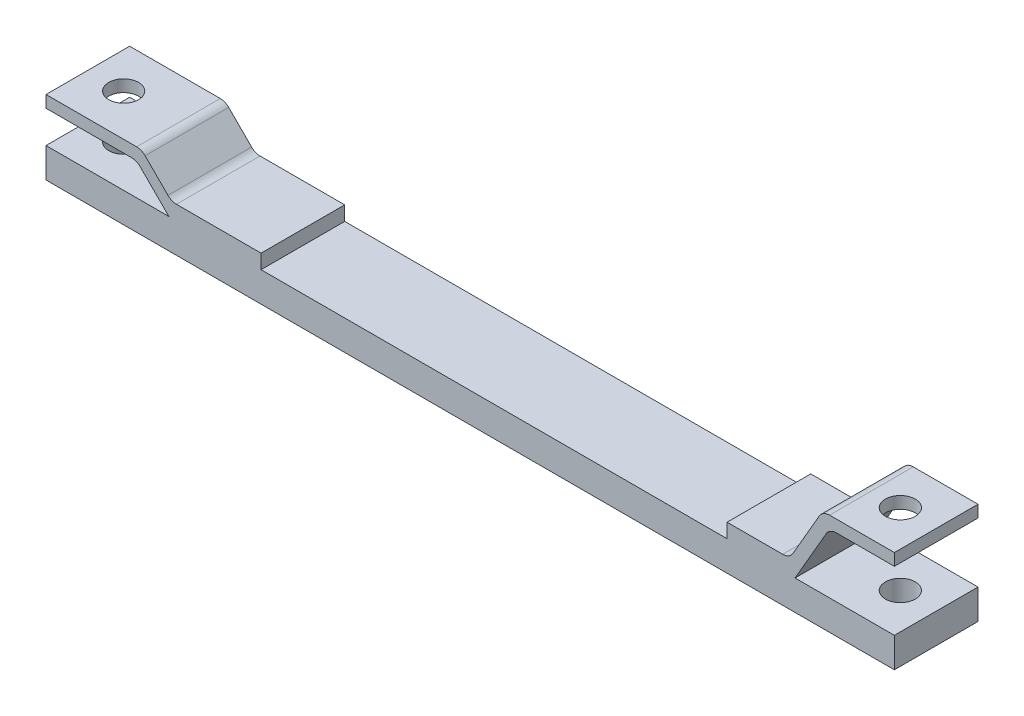
ISO-10303-21;
HEADER;
FILE_DESCRIPTION(('STEP AP214'),'2;1');
FILE_NAME('part.step','',(''),(''),'','','');
FILE_SCHEMA(('AUTOMOTIVE_DESIGN { 1 0 10303 214 1 1 1 1 }'));
ENDSEC;
DATA;
#1=APPLICATION_CONTEXT('core data for automotive mechanical design processes');
#2=APPLICATION_PROTOCOL_DEFINITION('international standard','automotive_design',2000,#1);
#3=PRODUCT_CONTEXT('',#1,'mechanical');
#4=PRODUCT('Part','Part','',(#3));
#5=PRODUCT_RELATED_PRODUCT_CATEGORY('part','',(#4));
#6=PRODUCT_DEFINITION_FORMATION('','',#4);
#7=PRODUCT_DEFINITION_CONTEXT('part definition',#1,'design');
#8=PRODUCT_DEFINITION('design','',#6,#7);
#9=PRODUCT_DEFINITION_SHAPE('','',#8);
#10=(LENGTH_UNIT() NAMED_UNIT(*) SI_UNIT(.MILLI.,.METRE.));
#11=(NAMED_UNIT(*) PLANE_ANGLE_UNIT() SI_UNIT($,.RADIAN.));
#12=(NAMED_UNIT(*) SI_UNIT($,.STERADIAN.) SOLID_ANGLE_UNIT());
#13=UNCERTAINTY_MEASURE_WITH_UNIT(LENGTH_MEASURE(1.E-05),#10,'distance_accuracy_value','');
#14=(GEOMETRIC_REPRESENTATION_CONTEXT(3) GLOBAL_UNCERTAINTY_ASSIGNED_CONTEXT((#13)) GLOBAL_UNIT_ASSIGNED_CONTEXT((#10,
#11,#12)) REPRESENTATION_CONTEXT('',''));
#15=CARTESIAN_POINT('',(0.,0.,0.));
#16=DIRECTION('',(0.,0.,1.));
#17=DIRECTION('',(1.,0.,0.));
#18=AXIS2_PLACEMENT_3D('',#15,#16,#17);
#19=CARTESIAN_POINT('',(63.9289321881345,63.9289321881345,70.));
#20=DIRECTION('',(0.707106781186548,0.707106781186548,0.));
#21=DIRECTION('',(-0.707106781186548,0.707106781186548,0.));
#22=AXIS2_PLACEMENT_3D('',#19,#20,#21);
#23=PLANE('',#22);
#24=DIRECTION('',(0.707106781186548,-0.707106781186548,0.));
#25=VECTOR('',#24,1.);
#26=CARTESIAN_POINT('',(63.9289321881345,63.9289321881345,70.));
#27=LINE('',#26,#25);
#28=CARTESIAN_POINT('',(78.7867965644036,49.0710678118655,70.));
#29=VERTEX_POINT('',#28);
#30=CARTESIAN_POINT('',(102.857864376269,25.,70.));
#31=VERTEX_POINT('',#30);
#32=EDGE_CURVE('E287',#29,#31,#27,.T.);
#33=ORIENTED_EDGE('',*,*,#32,.F.);
#34=DIRECTION('',(0.,0.,-1.));
#35=VECTOR('',#34,1.);
#36=CARTESIAN_POINT('',(78.7867965644036,49.0710678118655,0.));
#37=LINE('',#36,#35);
#38=CARTESIAN_POINT('',(78.7867965644036,49.0710678118655,0.));
#39=VERTEX_POINT('',#38);
#40=EDGE_CURVE('E385',#29,#39,#37,.T.);
#41=ORIENTED_EDGE('',*,*,#40,.T.);
#42=DIRECTION('',(0.707106781186548,-0.707106781186548,0.));
#43=VECTOR('',#42,1.);
#44=CARTESIAN_POINT('',(63.9289321881345,63.9289321881345,0.));
#45=LINE('',#44,#43);
#46=CARTESIAN_POINT('',(102.857864376269,25.,0.));
#47=VERTEX_POINT('',#46);
#48=EDGE_CURVE('E304',#39,#47,#45,.T.);
#49=ORIENTED_EDGE('',*,*,#48,.T.);
#50=DIRECTION('',(0.,0.,-1.));
#51=VECTOR('',#50,1.);
#52=CARTESIAN_POINT('',(102.857864376269,25.,70.));
#53=LINE('',#52,#51);
#54=EDGE_CURVE('E303',#31,#47,#53,.T.);
#55=ORIENTED_EDGE('',*,*,#54,.F.);
#56=EDGE_LOOP('',(#33,#41,#49,#55));
#57=FACE_BOUND('',#56,.T.);
#58=ADVANCED_FACE('F112',(#57),#23,.F.);
#59=CARTESIAN_POINT('',(180.,0.,70.));
#60=DIRECTION('',(1.,0.,0.));
#61=DIRECTION('',(0.,0.,-1.));
#62=AXIS2_PLACEMENT_3D('',#59,#60,#61);
#63=PLANE('',#62);
#64=DIRECTION('',(0.,-1.,0.));
#65=VECTOR('',#64,1.);
#66=CARTESIAN_POINT('',(180.,0.,0.));
#67=LINE('',#66,#65);
#68=CARTESIAN_POINT('',(180.,37.,0.));
#69=VERTEX_POINT('',#68);
#70=CARTESIAN_POINT('',(180.,25.,0.));
#71=VERTEX_POINT('',#70);
#72=EDGE_CURVE('E434',#69,#71,#67,.T.);
#73=ORIENTED_EDGE('',*,*,#72,.F.);
#74=DIRECTION('',(0.,0.,-1.));
#75=VECTOR('',#74,1.);
#76=CARTESIAN_POINT('',(180.,37.,70.));
#77=LINE('',#76,#75);
#78=CARTESIAN_POINT('',(180.,37.,70.));
#79=VERTEX_POINT('',#78);
#80=EDGE_CURVE('E453',#79,#69,#77,.T.);
#81=ORIENTED_EDGE('',*,*,#80,.F.);
#82=DIRECTION('',(0.,-1.,0.));
#83=VECTOR('',#82,1.);
#84=CARTESIAN_POINT('',(180.,0.,70.));
#85=LINE('',#84,#83);
#86=CARTESIAN_POINT('',(180.,25.,70.));
#87=VERTEX_POINT('',#86);
#88=EDGE_CURVE('E299',#79,#87,#85,.T.);
#89=ORIENTED_EDGE('',*,*,#88,.T.);
#90=DIRECTION('',(0.,0.,-1.));
#91=VECTOR('',#90,1.);
#92=CARTESIAN_POINT('',(180.,25.,70.));
#93=LINE('',#92,#91);
#94=EDGE_CURVE('E309',#87,#71,#93,.T.);
#95=ORIENTED_EDGE('',*,*,#94,.T.);
#96=EDGE_LOOP('',(#73,#81,#89,#95));
#97=FACE_BOUND('',#96,.T.);
#98=ADVANCED_FACE('F548',(#97),#63,.T.);
#99=CARTESIAN_POINT('',(0.,37.,70.));
#100=DIRECTION('',(0.,1.,0.));
#101=DIRECTION('',(0.,0.,1.));
#102=AXIS2_PLACEMENT_3D('',#99,#100,#101);
#103=PLANE('',#102);
#104=DIRECTION('',(1.,0.,0.));
#105=VECTOR('',#104,1.);
#106=CARTESIAN_POINT('',(0.,37.,0.));
#107=LINE('',#106,#105);
#108=CARTESIAN_POINT('',(109.142135623731,37.,0.));
#109=VERTEX_POINT('',#108);
#110=EDGE_CURVE('E438',#109,#69,#107,.T.);
#111=ORIENTED_EDGE('',*,*,#110,.F.);
#112=DIRECTION('',(0.,0.,-1.));
#113=VECTOR('',#112,1.);
#114=CARTESIAN_POINT('',(109.142135623731,37.,70.));
#115=LINE('',#114,#113);
#116=CARTESIAN_POINT('',(109.142135623731,37.,70.));
#117=VERTEX_POINT('',#116);
#118=EDGE_CURVE('E367',#109,#117,#115,.F.);
#119=ORIENTED_EDGE('',*,*,#118,.T.);
#120=DIRECTION('',(1.,0.,0.));
#121=VECTOR('',#120,1.);
#122=CARTESIAN_POINT('',(0.,37.,70.));
#123=LINE('',#122,#121);
#124=EDGE_CURVE('E420',#117,#79,#123,.T.);
#125=ORIENTED_EDGE('',*,*,#124,.T.);
#126=ORIENTED_EDGE('',*,*,#80,.T.);
#127=EDGE_LOOP('',(#111,#119,#125,#126));
#128=FACE_BOUND('',#127,.T.);
#129=ADVANCED_FACE('F552',(#128),#103,.T.);
#130=CARTESIAN_POINT('',(71.0000000000001,70.9999999999999,70.));
#131=DIRECTION('',(0.707106781186549,0.707106781186546,0.));
#132=DIRECTION('',(-0.707106781186546,0.707106781186549,0.));
#133=AXIS2_PLACEMENT_3D('',#130,#131,#132);
#134=PLANE('',#133);
#135=DIRECTION('',(0.707106781186546,-0.707106781186549,0.));
#136=VECTOR('',#135,1.);
#137=CARTESIAN_POINT('',(71.0000000000001,70.9999999999999,70.));
#138=LINE('',#137,#136);
#139=CARTESIAN_POINT('',(82.9289321881345,59.0710678118655,70.));
#140=VERTEX_POINT('',#139);
#141=CARTESIAN_POINT('',(102.071067811865,39.9289321881345,70.));
#142=VERTEX_POINT('',#141);
#143=EDGE_CURVE('E422',#140,#142,#138,.T.);
#144=ORIENTED_EDGE('',*,*,#143,.T.);
#145=DIRECTION('',(0.,0.,-1.));
#146=VECTOR('',#145,1.);
#147=CARTESIAN_POINT('',(102.071067811865,39.9289321881345,0.));
#148=LINE('',#147,#146);
#149=CARTESIAN_POINT('',(102.071067811865,39.9289321881345,0.));
#150=VERTEX_POINT('',#149);
#151=EDGE_CURVE('E364',#142,#150,#148,.T.);
#152=ORIENTED_EDGE('',*,*,#151,.T.);
#153=DIRECTION('',(0.707106781186546,-0.707106781186549,0.));
#154=VECTOR('',#153,1.);
#155=CARTESIAN_POINT('',(71.0000000000001,70.9999999999999,0.));
#156=LINE('',#155,#154);
#157=CARTESIAN_POINT('',(82.9289321881345,59.0710678118655,0.));
#158=VERTEX_POINT('',#157);
#159=EDGE_CURVE('E440',#158,#150,#156,.T.);
#160=ORIENTED_EDGE('',*,*,#159,.F.);
#161=DIRECTION('',(0.,0.,-1.));
#162=VECTOR('',#161,1.);
#163=CARTESIAN_POINT('',(82.9289321881345,59.0710678118655,70.));
#164=LINE('',#163,#162);
#165=EDGE_CURVE('E362',#158,#140,#164,.F.);
#166=ORIENTED_EDGE('',*,*,#165,.T.);
#167=EDGE_LOOP('',(#144,#152,#160,#166));
#168=FACE_BOUND('',#167,.T.);
#169=ADVANCED_FACE('F561',(#168),#134,.T.);
#170=CARTESIAN_POINT('',(0.,62.,70.));
#171=DIRECTION('',(0.,1.,0.));
#172=DIRECTION('',(0.,0.,1.));
#173=AXIS2_PLACEMENT_3D('',#170,#171,#172);
#174=PLANE('',#173);
#175=CARTESIAN_POINT('',(30.,62.,35.));
#176=DIRECTION('',(0.,1.,0.));
#177=DIRECTION('',(0.,0.,1.));
#178=AXIS2_PLACEMENT_3D('',#175,#176,#177);
#179=CIRCLE('',#178,12.5);
#180=CARTESIAN_POINT('',(30.,62.,47.5));
#181=VERTEX_POINT('',#180);
#182=EDGE_CURVE('E399',#181,#181,#179,.T.);
#183=ORIENTED_EDGE('',*,*,#182,.F.);
#184=EDGE_LOOP('',(#183));
#185=FACE_BOUND('',#184,.T.);
#186=DIRECTION('',(1.,0.,0.));
#187=VECTOR('',#186,1.);
#188=CARTESIAN_POINT('',(0.,62.,70.));
#189=LINE('',#188,#187);
#190=CARTESIAN_POINT('',(0.,62.,70.));
#191=VERTEX_POINT('',#190);
#192=CARTESIAN_POINT('',(75.857864376269,62.,70.));
#193=VERTEX_POINT('',#192);
#194=EDGE_CURVE('E425',#191,#193,#189,.T.);
#195=ORIENTED_EDGE('',*,*,#194,.T.);
#196=DIRECTION('',(0.,0.,-1.));
#197=VECTOR('',#196,1.);
#198=CARTESIAN_POINT('',(75.857864376269,62.,70.));
#199=LINE('',#198,#197);
#200=CARTESIAN_POINT('',(75.857864376269,62.,0.));
#201=VERTEX_POINT('',#200);
#202=EDGE_CURVE('E369',#193,#201,#199,.T.);
#203=ORIENTED_EDGE('',*,*,#202,.T.);
#204=DIRECTION('',(1.,0.,0.));
#205=VECTOR('',#204,1.);
#206=CARTESIAN_POINT('',(0.,62.,0.));
#207=LINE('',#206,#205);
#208=CARTESIAN_POINT('',(0.,62.,0.));
#209=VERTEX_POINT('',#208);
#210=EDGE_CURVE('E443',#209,#201,#207,.T.);
#211=ORIENTED_EDGE('',*,*,#210,.F.);
#212=DIRECTION('',(0.,0.,-1.));
#213=VECTOR('',#212,1.);
#214=CARTESIAN_POINT('',(0.,62.,70.));
#215=LINE('',#214,#213);
#216=EDGE_CURVE('E451',#191,#209,#215,.T.);
#217=ORIENTED_EDGE('',*,*,#216,.F.);
#218=EDGE_LOOP('',(#195,#203,#211,#217));
#219=FACE_BOUND('',#218,.T.);
#220=ADVANCED_FACE('F570',(#185,#219),#174,.T.);
#221=CARTESIAN_POINT('',(0.,0.,70.));
#222=DIRECTION('',(1.,0.,0.));
#223=DIRECTION('',(0.,0.,-1.));
#224=AXIS2_PLACEMENT_3D('',#221,#222,#223);
#225=PLANE('',#224);
#226=DIRECTION('',(0.,-1.,0.));
#227=VECTOR('',#226,1.);
#228=CARTESIAN_POINT('',(0.,0.,0.));
#229=LINE('',#228,#227);
#230=CARTESIAN_POINT('',(0.,52.,0.));
#231=VERTEX_POINT('',#230);
#232=EDGE_CURVE('E446',#209,#231,#229,.T.);
#233=ORIENTED_EDGE('',*,*,#232,.T.);
#234=DIRECTION('',(0.,0.,-1.));
#235=VECTOR('',#234,1.);
#236=CARTESIAN_POINT('',(0.,52.,70.));
#237=LINE('',#236,#235);
#238=CARTESIAN_POINT('',(0.,52.,70.));
#239=VERTEX_POINT('',#238);
#240=EDGE_CURVE('E432',#239,#231,#237,.T.);
#241=ORIENTED_EDGE('',*,*,#240,.F.);
#242=DIRECTION('',(0.,-1.,0.));
#243=VECTOR('',#242,1.);
#244=CARTESIAN_POINT('',(0.,0.,70.));
#245=LINE('',#244,#243);
#246=EDGE_CURVE('E428',#191,#239,#245,.T.);
#247=ORIENTED_EDGE('',*,*,#246,.F.);
#248=ORIENTED_EDGE('',*,*,#216,.T.);
#249=EDGE_LOOP('',(#233,#241,#247,#248));
#250=FACE_BOUND('',#249,.T.);
#251=ADVANCED_FACE('F575',(#250),#225,.F.);
#252=CARTESIAN_POINT('',(0.,52.,70.));
#253=DIRECTION('',(0.,1.,0.));
#254=DIRECTION('',(0.,0.,1.));
#255=AXIS2_PLACEMENT_3D('',#252,#253,#254);
#256=PLANE('',#255);
#257=CARTESIAN_POINT('',(30.,52.,35.));
#258=DIRECTION('',(0.,1.,0.));
#259=DIRECTION('',(0.,0.,1.));
#260=AXIS2_PLACEMENT_3D('',#257,#258,#259);
#261=CIRCLE('',#260,12.5);
#262=CARTESIAN_POINT('',(30.,52.,47.5));
#263=VERTEX_POINT('',#262);
#264=EDGE_CURVE('E394',#263,#263,#261,.T.);
#265=ORIENTED_EDGE('',*,*,#264,.T.);
#266=EDGE_LOOP('',(#265));
#267=FACE_BOUND('',#266,.T.);
#268=DIRECTION('',(1.,0.,0.));
#269=VECTOR('',#268,1.);
#270=CARTESIAN_POINT('',(0.,52.,0.));
#271=LINE('',#270,#269);
#272=CARTESIAN_POINT('',(71.7157287525381,52.,0.));
#273=VERTEX_POINT('',#272);
#274=EDGE_CURVE('E300',#231,#273,#271,.T.);
#275=ORIENTED_EDGE('',*,*,#274,.T.);
#276=DIRECTION('',(0.,0.,-1.));
#277=VECTOR('',#276,1.);
#278=CARTESIAN_POINT('',(71.7157287525381,52.,70.));
#279=LINE('',#278,#277);
#280=CARTESIAN_POINT('',(71.7157287525381,52.,70.));
#281=VERTEX_POINT('',#280);
#282=EDGE_CURVE('E129',#273,#281,#279,.F.);
#283=ORIENTED_EDGE('',*,*,#282,.T.);
#284=DIRECTION('',(1.,0.,0.));
#285=VECTOR('',#284,1.);
#286=CARTESIAN_POINT('',(0.,52.,70.));
#287=LINE('',#286,#285);
#288=EDGE_CURVE('E430',#239,#281,#287,.T.);
#289=ORIENTED_EDGE('',*,*,#288,.F.);
#290=ORIENTED_EDGE('',*,*,#240,.T.);
#291=EDGE_LOOP('',(#275,#283,#289,#290));
#292=FACE_BOUND('',#291,.T.);
#293=ADVANCED_FACE('F576',(#267,#292),#256,.F.);
#294=CARTESIAN_POINT('',(0.,0.,70.));
#295=DIRECTION('',(0.,0.,1.));
#296=DIRECTION('',(1.,0.,0.));
#297=AXIS2_PLACEMENT_3D('',#294,#295,#296);
#298=PLANE('',#297);
#299=DIRECTION('',(-1.,0.,0.));
#300=VECTOR('',#299,1.);
#301=CARTESIAN_POINT('',(0.,84.9999999999997,70.));
#302=LINE('',#301,#300);
#303=CARTESIAN_POINT('',(710.,85.,70.));
#304=VERTEX_POINT('',#303);
#305=CARTESIAN_POINT('',(655.773502691896,85.,70.));
#306=VERTEX_POINT('',#305);
#307=EDGE_CURVE('E466',#304,#306,#302,.T.);
#308=ORIENTED_EDGE('',*,*,#307,.T.);
#309=CARTESIAN_POINT('',(655.773502691896,75.,70.));
#310=DIRECTION('',(0.,0.,1.));
#311=DIRECTION('',(1.,0.,0.));
#312=AXIS2_PLACEMENT_3D('',#309,#310,#311);
#313=CIRCLE('',#312,10.);
#314=CARTESIAN_POINT('',(647.113248654052,80.0000000000001,70.));
#315=VERTEX_POINT('',#314);
#316=EDGE_CURVE('E360',#306,#315,#313,.T.);
#317=ORIENTED_EDGE('',*,*,#316,.T.);
#318=DIRECTION('',(-0.500000000000004,-0.866025403784437,0.));
#319=VECTOR('',#318,1.);
#320=CARTESIAN_POINT('',(450.693920339159,-260.208256229944,70.));
#321=LINE('',#320,#319);
#322=CARTESIAN_POINT('',(625.173938424846,42.0000000000001,70.));
#323=VERTEX_POINT('',#322);
#324=EDGE_CURVE('E468',#315,#323,#321,.T.);
#325=ORIENTED_EDGE('',*,*,#324,.T.);
#326=CARTESIAN_POINT('',(616.513684387001,47.,70.));
#327=DIRECTION('',(0.,0.,1.));
#328=DIRECTION('',(1.,0.,0.));
#329=AXIS2_PLACEMENT_3D('',#326,#327,#328);
#330=CIRCLE('',#329,10.);
#331=CARTESIAN_POINT('',(616.513684387001,37.,70.));
#332=VERTEX_POINT('',#331);
#333=EDGE_CURVE('E374',#323,#332,#330,.F.);
#334=ORIENTED_EDGE('',*,*,#333,.T.);
#335=DIRECTION('',(-1.,0.,0.));
#336=VECTOR('',#335,1.);
#337=CARTESIAN_POINT('',(0.,36.9999999999999,70.));
#338=LINE('',#337,#336);
#339=CARTESIAN_POINT('',(570.,37.,70.));
#340=VERTEX_POINT('',#339);
#341=EDGE_CURVE('E471',#332,#340,#338,.T.);
#342=ORIENTED_EDGE('',*,*,#341,.T.);
#343=DIRECTION('',(0.,-1.,0.));
#344=VECTOR('',#343,1.);
#345=CARTESIAN_POINT('',(570.,0.,70.));
#346=LINE('',#345,#344);
#347=CARTESIAN_POINT('',(570.,25.,70.));
#348=VERTEX_POINT('',#347);
#349=EDGE_CURVE('E473',#340,#348,#346,.T.);
#350=ORIENTED_EDGE('',*,*,#349,.T.);
#351=DIRECTION('',(1.,0.,0.));
#352=VECTOR('',#351,1.);
#353=CARTESIAN_POINT('',(0.,25.,70.));
#354=LINE('',#353,#352);
#355=EDGE_CURVE('E314',#87,#348,#354,.T.);
#356=ORIENTED_EDGE('',*,*,#355,.F.);
#357=ORIENTED_EDGE('',*,*,#88,.F.);
#358=ORIENTED_EDGE('',*,*,#124,.F.);
#359=CARTESIAN_POINT('',(109.142135623731,47.,70.));
#360=DIRECTION('',(0.,0.,1.));
#361=DIRECTION('',(1.,0.,0.));
#362=AXIS2_PLACEMENT_3D('',#359,#360,#361);
#363=CIRCLE('',#362,10.);
#364=EDGE_CURVE('E378',#117,#142,#363,.F.);
#365=ORIENTED_EDGE('',*,*,#364,.T.);
#366=ORIENTED_EDGE('',*,*,#143,.F.);
#367=CARTESIAN_POINT('',(75.857864376269,52.,70.));
#368=DIRECTION('',(0.,0.,1.));
#369=DIRECTION('',(1.,0.,0.));
#370=AXIS2_PLACEMENT_3D('',#367,#368,#369);
#371=CIRCLE('',#370,10.);
#372=EDGE_CURVE('E358',#140,#193,#371,.T.);
#373=ORIENTED_EDGE('',*,*,#372,.T.);
#374=ORIENTED_EDGE('',*,*,#194,.F.);
#375=ORIENTED_EDGE('',*,*,#246,.T.);
#376=ORIENTED_EDGE('',*,*,#288,.T.);
#377=CARTESIAN_POINT('',(71.7157287525381,42.,70.));
#378=DIRECTION('',(0.,0.,1.));
#379=DIRECTION('',(1.,0.,0.));
#380=AXIS2_PLACEMENT_3D('',#377,#378,#379);
#381=CIRCLE('',#380,10.);
#382=EDGE_CURVE('E12',#281,#29,#381,.F.);
#383=ORIENTED_EDGE('',*,*,#382,.T.);
#384=ORIENTED_EDGE('',*,*,#32,.T.);
#385=CARTESIAN_POINT('',(0.,25.,70.));
#386=VERTEX_POINT('',#385);
#387=EDGE_CURVE('E293',#386,#31,#354,.T.);
#388=ORIENTED_EDGE('',*,*,#387,.F.);
#389=DIRECTION('',(0.,1.,0.));
#390=VECTOR('',#389,1.);
#391=CARTESIAN_POINT('',(0.,0.,70.));
#392=LINE('',#391,#390);
#393=CARTESIAN_POINT('',(0.,0.,70.));
#394=VERTEX_POINT('',#393);
#395=EDGE_CURVE('E344',#394,#386,#392,.T.);
#396=ORIENTED_EDGE('',*,*,#395,.F.);
#397=DIRECTION('',(1.,0.,0.));
#398=VECTOR('',#397,1.);
#399=CARTESIAN_POINT('',(0.,0.,70.));
#400=LINE('',#399,#398);
#401=CARTESIAN_POINT('',(710.,0.,70.));
#402=VERTEX_POINT('',#401);
#403=EDGE_CURVE('E318',#394,#402,#400,.T.);
#404=ORIENTED_EDGE('',*,*,#403,.T.);
#405=DIRECTION('',(0.,1.,0.));
#406=VECTOR('',#405,1.);
#407=CARTESIAN_POINT('',(710.,0.,70.));
#408=LINE('',#407,#406);
#409=CARTESIAN_POINT('',(710.,25.,70.));
#410=VERTEX_POINT('',#409);
#411=EDGE_CURVE('E313',#402,#410,#408,.T.);
#412=ORIENTED_EDGE('',*,*,#411,.T.);
#413=CARTESIAN_POINT('',(626.905989232415,25.,70.));
#414=VERTEX_POINT('',#413);
#415=EDGE_CURVE('E316',#414,#410,#354,.T.);
#416=ORIENTED_EDGE('',*,*,#415,.F.);
#417=DIRECTION('',(-0.500000000000015,-0.86602540378443,0.));
#418=VECTOR('',#417,1.);
#419=CARTESIAN_POINT('',(459.354174376996,-265.208256229948,70.));
#420=LINE('',#419,#418);
#421=CARTESIAN_POINT('',(652.886751345949,70.0000000000002,70.));
#422=VERTEX_POINT('',#421);
#423=EDGE_CURVE('E457',#422,#414,#420,.T.);
#424=ORIENTED_EDGE('',*,*,#423,.F.);
#425=CARTESIAN_POINT('',(661.547005383793,65.,70.));
#426=DIRECTION('',(0.,0.,1.));
#427=DIRECTION('',(1.,0.,0.));
#428=AXIS2_PLACEMENT_3D('',#425,#426,#427);
#429=CIRCLE('',#428,10.);
#430=CARTESIAN_POINT('',(661.547005383793,75.,70.));
#431=VERTEX_POINT('',#430);
#432=EDGE_CURVE('E390',#422,#431,#429,.F.);
#433=ORIENTED_EDGE('',*,*,#432,.T.);
#434=DIRECTION('',(-1.,0.,0.));
#435=VECTOR('',#434,1.);
#436=CARTESIAN_POINT('',(0.,75.,70.));
#437=LINE('',#436,#435);
#438=CARTESIAN_POINT('',(710.,75.,70.));
#439=VERTEX_POINT('',#438);
#440=EDGE_CURVE('E459',#439,#431,#437,.T.);
#441=ORIENTED_EDGE('',*,*,#440,.F.);
#442=DIRECTION('',(0.,-1.,0.));
#443=VECTOR('',#442,1.);
#444=CARTESIAN_POINT('',(710.,0.,70.));
#445=LINE('',#444,#443);
#446=EDGE_CURVE('E463',#304,#439,#445,.T.);
#447=ORIENTED_EDGE('',*,*,#446,.F.);
#448=EDGE_LOOP('',(#308,#317,#325,#334,#342,#350,#356,#357,#358,#365,#366,#373,#374,#375,#376,
#383,#384,#388,#396,#404,#412,#416,#424,#433,#441,#447));
#449=FACE_BOUND('',#448,.T.);
#450=ADVANCED_FACE('F290',(#449),#298,.T.);
#451=CARTESIAN_POINT('',(0.,0.,0.));
#452=DIRECTION('',(0.,0.,1.));
#453=DIRECTION('',(1.,0.,0.));
#454=AXIS2_PLACEMENT_3D('',#451,#452,#453);
#455=PLANE('',#454);
#456=DIRECTION('',(-0.500000000000004,-0.866025403784437,0.));
#457=VECTOR('',#456,1.);
#458=CARTESIAN_POINT('',(450.693920339159,-260.208256229944,0.));
#459=LINE('',#458,#457);
#460=CARTESIAN_POINT('',(647.113248654052,80.0000000000001,0.));
#461=VERTEX_POINT('',#460);
#462=CARTESIAN_POINT('',(625.173938424846,42.0000000000001,0.));
#463=VERTEX_POINT('',#462);
#464=EDGE_CURVE('E487',#461,#463,#459,.T.);
#465=ORIENTED_EDGE('',*,*,#464,.F.);
#466=CARTESIAN_POINT('',(655.773502691896,75.,0.));
#467=DIRECTION('',(0.,0.,1.));
#468=DIRECTION('',(1.,0.,0.));
#469=AXIS2_PLACEMENT_3D('',#466,#467,#468);
#470=CIRCLE('',#469,10.);
#471=CARTESIAN_POINT('',(655.773502691896,85.,0.));
#472=VERTEX_POINT('',#471);
#473=EDGE_CURVE('E354',#461,#472,#470,.F.);
#474=ORIENTED_EDGE('',*,*,#473,.T.);
#475=DIRECTION('',(-1.,0.,0.));
#476=VECTOR('',#475,1.);
#477=CARTESIAN_POINT('',(0.,84.9999999999997,0.));
#478=LINE('',#477,#476);
#479=CARTESIAN_POINT('',(710.,85.,0.));
#480=VERTEX_POINT('',#479);
#481=EDGE_CURVE('E484',#480,#472,#478,.T.);
#482=ORIENTED_EDGE('',*,*,#481,.F.);
#483=DIRECTION('',(0.,-1.,0.));
#484=VECTOR('',#483,1.);
#485=CARTESIAN_POINT('',(710.,0.,0.));
#486=LINE('',#485,#484);
#487=CARTESIAN_POINT('',(710.,75.,0.));
#488=VERTEX_POINT('',#487);
#489=EDGE_CURVE('E481',#480,#488,#486,.T.);
#490=ORIENTED_EDGE('',*,*,#489,.T.);
#491=DIRECTION('',(-1.,0.,0.));
#492=VECTOR('',#491,1.);
#493=CARTESIAN_POINT('',(0.,75.,0.));
#494=LINE('',#493,#492);
#495=CARTESIAN_POINT('',(661.547005383793,75.,0.));
#496=VERTEX_POINT('',#495);
#497=EDGE_CURVE('E478',#488,#496,#494,.T.);
#498=ORIENTED_EDGE('',*,*,#497,.T.);
#499=CARTESIAN_POINT('',(661.547005383793,65.,0.));
#500=DIRECTION('',(0.,0.,1.));
#501=DIRECTION('',(1.,0.,0.));
#502=AXIS2_PLACEMENT_3D('',#499,#500,#501);
#503=CIRCLE('',#502,10.);
#504=CARTESIAN_POINT('',(652.886751345949,70.0000000000002,0.));
#505=VERTEX_POINT('',#504);
#506=EDGE_CURVE('E388',#496,#505,#503,.T.);
#507=ORIENTED_EDGE('',*,*,#506,.T.);
#508=DIRECTION('',(-0.500000000000015,-0.86602540378443,0.));
#509=VECTOR('',#508,1.);
#510=CARTESIAN_POINT('',(459.354174376996,-265.208256229948,0.));
#511=LINE('',#510,#509);
#512=CARTESIAN_POINT('',(626.905989232415,25.,0.));
#513=VERTEX_POINT('',#512);
#514=EDGE_CURVE('E336',#505,#513,#511,.T.);
#515=ORIENTED_EDGE('',*,*,#514,.T.);
#516=DIRECTION('',(1.,0.,0.));
#517=VECTOR('',#516,1.);
#518=CARTESIAN_POINT('',(0.,25.,0.));
#519=LINE('',#518,#517);
#520=CARTESIAN_POINT('',(710.,25.,0.));
#521=VERTEX_POINT('',#520);
#522=EDGE_CURVE('E416',#513,#521,#519,.T.);
#523=ORIENTED_EDGE('',*,*,#522,.T.);
#524=DIRECTION('',(0.,1.,0.));
#525=VECTOR('',#524,1.);
#526=CARTESIAN_POINT('',(710.,0.,0.));
#527=LINE('',#526,#525);
#528=CARTESIAN_POINT('',(710.,0.,0.));
#529=VERTEX_POINT('',#528);
#530=EDGE_CURVE('E331',#529,#521,#527,.T.);
#531=ORIENTED_EDGE('',*,*,#530,.F.);
#532=DIRECTION('',(1.,0.,0.));
#533=VECTOR('',#532,1.);
#534=CARTESIAN_POINT('',(0.,0.,0.));
#535=LINE('',#534,#533);
#536=CARTESIAN_POINT('',(0.,0.,0.));
#537=VERTEX_POINT('',#536);
#538=EDGE_CURVE('E327',#537,#529,#535,.T.);
#539=ORIENTED_EDGE('',*,*,#538,.F.);
#540=DIRECTION('',(0.,1.,0.));
#541=VECTOR('',#540,1.);
#542=CARTESIAN_POINT('',(0.,0.,0.));
#543=LINE('',#542,#541);
#544=CARTESIAN_POINT('',(0.,25.,0.));
#545=VERTEX_POINT('',#544);
#546=EDGE_CURVE('E321',#537,#545,#543,.T.);
#547=ORIENTED_EDGE('',*,*,#546,.T.);
#548=EDGE_CURVE('E621',#545,#47,#519,.T.);
#549=ORIENTED_EDGE('',*,*,#548,.T.);
#550=ORIENTED_EDGE('',*,*,#48,.F.);
#551=CARTESIAN_POINT('',(71.7157287525381,42.,0.));
#552=DIRECTION('',(0.,0.,1.));
#553=DIRECTION('',(1.,0.,0.));
#554=AXIS2_PLACEMENT_3D('',#551,#552,#553);
#555=CIRCLE('',#554,10.);
#556=EDGE_CURVE('E121',#39,#273,#555,.T.);
#557=ORIENTED_EDGE('',*,*,#556,.T.);
#558=ORIENTED_EDGE('',*,*,#274,.F.);
#559=ORIENTED_EDGE('',*,*,#232,.F.);
#560=ORIENTED_EDGE('',*,*,#210,.T.);
#561=CARTESIAN_POINT('',(75.857864376269,52.,0.));
#562=DIRECTION('',(0.,0.,1.));
#563=DIRECTION('',(1.,0.,0.));
#564=AXIS2_PLACEMENT_3D('',#561,#562,#563);
#565=CIRCLE('',#564,10.);
#566=EDGE_CURVE('E352',#201,#158,#565,.F.);
#567=ORIENTED_EDGE('',*,*,#566,.T.);
#568=ORIENTED_EDGE('',*,*,#159,.T.);
#569=CARTESIAN_POINT('',(109.142135623731,47.,0.));
#570=DIRECTION('',(0.,0.,1.));
#571=DIRECTION('',(1.,0.,0.));
#572=AXIS2_PLACEMENT_3D('',#569,#570,#571);
#573=CIRCLE('',#572,10.);
#574=EDGE_CURVE('E376',#150,#109,#573,.T.);
#575=ORIENTED_EDGE('',*,*,#574,.T.);
#576=ORIENTED_EDGE('',*,*,#110,.T.);
#577=ORIENTED_EDGE('',*,*,#72,.T.);
#578=CARTESIAN_POINT('',(570.,25.,0.));
#579=VERTEX_POINT('',#578);
#580=EDGE_CURVE('E622',#71,#579,#519,.T.);
#581=ORIENTED_EDGE('',*,*,#580,.T.);
#582=DIRECTION('',(0.,-1.,0.));
#583=VECTOR('',#582,1.);
#584=CARTESIAN_POINT('',(570.,0.,0.));
#585=LINE('',#584,#583);
#586=CARTESIAN_POINT('',(570.,37.,0.));
#587=VERTEX_POINT('',#586);
#588=EDGE_CURVE('E460',#587,#579,#585,.T.);
#589=ORIENTED_EDGE('',*,*,#588,.F.);
#590=DIRECTION('',(-1.,0.,0.));
#591=VECTOR('',#590,1.);
#592=CARTESIAN_POINT('',(0.,36.9999999999999,0.));
#593=LINE('',#592,#591);
#594=CARTESIAN_POINT('',(616.513684387001,37.,0.));
#595=VERTEX_POINT('',#594);
#596=EDGE_CURVE('E490',#595,#587,#593,.T.);
#597=ORIENTED_EDGE('',*,*,#596,.F.);
#598=CARTESIAN_POINT('',(616.513684387001,47.,0.));
#599=DIRECTION('',(0.,0.,1.));
#600=DIRECTION('',(1.,0.,0.));
#601=AXIS2_PLACEMENT_3D('',#598,#599,#600);
#602=CIRCLE('',#601,10.);
#603=EDGE_CURVE('E372',#595,#463,#602,.T.);
#604=ORIENTED_EDGE('',*,*,#603,.T.);
#605=EDGE_LOOP('',(#465,#474,#482,#490,#498,#507,#515,#523,#531,#539,#547,#549,#550,#557,#558,
#559,#560,#567,#568,#575,#576,#577,#581,#589,#597,#604));
#606=FACE_BOUND('',#605,.T.);
#607=ADVANCED_FACE('F514',(#606),#455,.F.);
#608=CARTESIAN_POINT('',(0.,75.,70.));
#609=DIRECTION('',(0.,-1.,0.));
#610=DIRECTION('',(0.,0.,-1.));
#611=AXIS2_PLACEMENT_3D('',#608,#609,#610);
#612=PLANE('',#611);
#613=CARTESIAN_POINT('',(680.,75.,35.));
#614=DIRECTION('',(0.,-1.,0.));
#615=DIRECTION('',(0.,0.,-1.));
#616=AXIS2_PLACEMENT_3D('',#613,#614,#615);
#617=CIRCLE('',#616,12.5);
#618=CARTESIAN_POINT('',(680.,75.,22.5));
#619=VERTEX_POINT('',#618);
#620=EDGE_CURVE('E414',#619,#619,#617,.T.);
#621=ORIENTED_EDGE('',*,*,#620,.F.);
#622=EDGE_LOOP('',(#621));
#623=FACE_BOUND('',#622,.T.);
#624=ORIENTED_EDGE('',*,*,#440,.T.);
#625=DIRECTION('',(0.,0.,-1.));
#626=VECTOR('',#625,1.);
#627=CARTESIAN_POINT('',(661.547005383793,75.,0.));
#628=LINE('',#627,#626);
#629=EDGE_CURVE('E380',#431,#496,#628,.T.);
#630=ORIENTED_EDGE('',*,*,#629,.T.);
#631=ORIENTED_EDGE('',*,*,#497,.F.);
#632=DIRECTION('',(0.,0.,-1.));
#633=VECTOR('',#632,1.);
#634=CARTESIAN_POINT('',(710.,75.,70.));
#635=LINE('',#634,#633);
#636=EDGE_CURVE('E435',#439,#488,#635,.T.);
#637=ORIENTED_EDGE('',*,*,#636,.F.);
#638=EDGE_LOOP('',(#624,#630,#631,#637));
#639=FACE_BOUND('',#638,.T.);
#640=ADVANCED_FACE('F510',(#623,#639),#612,.T.);
#641=CARTESIAN_POINT('',(710.,0.,70.));
#642=DIRECTION('',(1.,0.,0.));
#643=DIRECTION('',(0.,0.,-1.));
#644=AXIS2_PLACEMENT_3D('',#641,#642,#643);
#645=PLANE('',#644);
#646=ORIENTED_EDGE('',*,*,#489,.F.);
#647=DIRECTION('',(0.,0.,-1.));
#648=VECTOR('',#647,1.);
#649=CARTESIAN_POINT('',(710.,85.,70.));
#650=LINE('',#649,#648);
#651=EDGE_CURVE('E502',#304,#480,#650,.T.);
#652=ORIENTED_EDGE('',*,*,#651,.F.);
#653=ORIENTED_EDGE('',*,*,#446,.T.);
#654=ORIENTED_EDGE('',*,*,#636,.T.);
#655=EDGE_LOOP('',(#646,#652,#653,#654));
#656=FACE_BOUND('',#655,.T.);
#657=ADVANCED_FACE('F506',(#656),#645,.T.);
#658=CARTESIAN_POINT('',(0.,84.9999999999997,70.));
#659=DIRECTION('',(0.,-1.,0.));
#660=DIRECTION('',(1.,0.,0.));
#661=AXIS2_PLACEMENT_3D('',#658,#659,#660);
#662=PLANE('',#661);
#663=CARTESIAN_POINT('',(680.,85.,35.));
#664=DIRECTION('',(0.,1.,0.));
#665=DIRECTION('',(-1.,0.,0.));
#666=AXIS2_PLACEMENT_3D('',#663,#664,#665);
#667=CIRCLE('',#666,12.5);
#668=CARTESIAN_POINT('',(667.5,85.,35.));
#669=VERTEX_POINT('',#668);
#670=EDGE_CURVE('E402',#669,#669,#667,.T.);
#671=ORIENTED_EDGE('',*,*,#670,.F.);
#672=EDGE_LOOP('',(#671));
#673=FACE_BOUND('',#672,.T.);
#674=ORIENTED_EDGE('',*,*,#481,.T.);
#675=DIRECTION('',(0.,0.,-1.));
#676=VECTOR('',#675,1.);
#677=CARTESIAN_POINT('',(655.773502691896,85.,70.));
#678=LINE('',#677,#676);
#679=EDGE_CURVE('E356',#472,#306,#678,.F.);
#680=ORIENTED_EDGE('',*,*,#679,.T.);
#681=ORIENTED_EDGE('',*,*,#307,.F.);
#682=ORIENTED_EDGE('',*,*,#651,.T.);
#683=EDGE_LOOP('',(#674,#680,#681,#682));
#684=FACE_BOUND('',#683,.T.);
#685=ADVANCED_FACE('F517',(#673,#684),#662,.F.);
#686=CARTESIAN_POINT('',(450.693920339159,-260.208256229944,70.));
#687=DIRECTION('',(0.866025403784436,-0.500000000000004,0.));
#688=DIRECTION('',(0.500000000000004,0.866025403784437,0.));
#689=AXIS2_PLACEMENT_3D('',#686,#687,#688);
#690=PLANE('',#689);
#691=ORIENTED_EDGE('',*,*,#464,.T.);
#692=DIRECTION('',(0.,0.,-1.));
#693=VECTOR('',#692,1.);
#694=CARTESIAN_POINT('',(625.173938424846,42.,70.));
#695=LINE('',#694,#693);
#696=EDGE_CURVE('E350',#463,#323,#695,.F.);
#697=ORIENTED_EDGE('',*,*,#696,.T.);
#698=ORIENTED_EDGE('',*,*,#324,.F.);
#699=DIRECTION('',(0.,0.,-1.));
#700=VECTOR('',#699,1.);
#701=CARTESIAN_POINT('',(647.113248654052,80.,70.));
#702=LINE('',#701,#700);
#703=EDGE_CURVE('E347',#315,#461,#702,.T.);
#704=ORIENTED_EDGE('',*,*,#703,.T.);
#705=EDGE_LOOP('',(#691,#697,#698,#704));
#706=FACE_BOUND('',#705,.T.);
#707=ADVANCED_FACE('F526',(#706),#690,.F.);
#708=CARTESIAN_POINT('',(0.,36.9999999999999,70.));
#709=DIRECTION('',(0.,-1.,0.));
#710=DIRECTION('',(1.,0.,0.));
#711=AXIS2_PLACEMENT_3D('',#708,#709,#710);
#712=PLANE('',#711);
#713=ORIENTED_EDGE('',*,*,#341,.F.);
#714=DIRECTION('',(0.,0.,-1.));
#715=VECTOR('',#714,1.);
#716=CARTESIAN_POINT('',(616.513684387001,37.,0.));
#717=LINE('',#716,#715);
#718=EDGE_CURVE('E308',#332,#595,#717,.T.);
#719=ORIENTED_EDGE('',*,*,#718,.T.);
#720=ORIENTED_EDGE('',*,*,#596,.T.);
#721=DIRECTION('',(0.,0.,-1.));
#722=VECTOR('',#721,1.);
#723=CARTESIAN_POINT('',(570.,37.,70.));
#724=LINE('',#723,#722);
#725=EDGE_CURVE('E499',#340,#587,#724,.T.);
#726=ORIENTED_EDGE('',*,*,#725,.F.);
#727=EDGE_LOOP('',(#713,#719,#720,#726));
#728=FACE_BOUND('',#727,.T.);
#729=ADVANCED_FACE('F534',(#728),#712,.F.);
#730=CARTESIAN_POINT('',(459.354174376996,-265.208256229948,70.));
#731=DIRECTION('',(0.86602540378443,-0.500000000000015,0.));
#732=DIRECTION('',(0.500000000000015,0.86602540378443,0.));
#733=AXIS2_PLACEMENT_3D('',#730,#731,#732);
#734=PLANE('',#733);
#735=ORIENTED_EDGE('',*,*,#514,.F.);
#736=DIRECTION('',(0.,0.,-1.));
#737=VECTOR('',#736,1.);
#738=CARTESIAN_POINT('',(652.886751345949,70.0000000000001,70.));
#739=LINE('',#738,#737);
#740=EDGE_CURVE('E383',#505,#422,#739,.F.);
#741=ORIENTED_EDGE('',*,*,#740,.T.);
#742=ORIENTED_EDGE('',*,*,#423,.T.);
#743=DIRECTION('',(0.,0.,-1.));
#744=VECTOR('',#743,1.);
#745=CARTESIAN_POINT('',(626.905989232415,25.,70.));
#746=LINE('',#745,#744);
#747=EDGE_CURVE('E476',#414,#513,#746,.T.);
#748=ORIENTED_EDGE('',*,*,#747,.T.);
#749=EDGE_LOOP('',(#735,#741,#742,#748));
#750=FACE_BOUND('',#749,.T.);
#751=ADVANCED_FACE('F607',(#750),#734,.T.);
#752=CARTESIAN_POINT('',(570.,0.,70.));
#753=DIRECTION('',(1.,0.,0.));
#754=DIRECTION('',(0.,0.,-1.));
#755=AXIS2_PLACEMENT_3D('',#752,#753,#754);
#756=PLANE('',#755);
#757=ORIENTED_EDGE('',*,*,#588,.T.);
#758=DIRECTION('',(0.,0.,-1.));
#759=VECTOR('',#758,1.);
#760=CARTESIAN_POINT('',(570.,25.,70.));
#761=LINE('',#760,#759);
#762=EDGE_CURVE('E496',#348,#579,#761,.T.);
#763=ORIENTED_EDGE('',*,*,#762,.F.);
#764=ORIENTED_EDGE('',*,*,#349,.F.);
#765=ORIENTED_EDGE('',*,*,#725,.T.);
#766=EDGE_LOOP('',(#757,#763,#764,#765));
#767=FACE_BOUND('',#766,.T.);
#768=ADVANCED_FACE('F540',(#767),#756,.F.);
#769=CARTESIAN_POINT('',(0.,0.,70.));
#770=DIRECTION('',(-1.,0.,0.));
#771=DIRECTION('',(0.,0.,1.));
#772=AXIS2_PLACEMENT_3D('',#769,#770,#771);
#773=PLANE('',#772);
#774=ORIENTED_EDGE('',*,*,#546,.F.);
#775=DIRECTION('',(0.,0.,-1.));
#776=VECTOR('',#775,1.);
#777=CARTESIAN_POINT('',(0.,0.,70.));
#778=LINE('',#777,#776);
#779=EDGE_CURVE('E337',#394,#537,#778,.T.);
#780=ORIENTED_EDGE('',*,*,#779,.F.);
#781=ORIENTED_EDGE('',*,*,#395,.T.);
#782=DIRECTION('',(0.,0.,-1.));
#783=VECTOR('',#782,1.);
#784=CARTESIAN_POINT('',(0.,25.,70.));
#785=LINE('',#784,#783);
#786=EDGE_CURVE('E312',#386,#545,#785,.T.);
#787=ORIENTED_EDGE('',*,*,#786,.T.);
#788=EDGE_LOOP('',(#774,#780,#781,#787));
#789=FACE_BOUND('',#788,.T.);
#790=ADVANCED_FACE('F597',(#789),#773,.T.);
#791=CARTESIAN_POINT('',(0.,0.,70.));
#792=DIRECTION('',(0.,1.,0.));
#793=DIRECTION('',(0.,0.,1.));
#794=AXIS2_PLACEMENT_3D('',#791,#792,#793);
#795=PLANE('',#794);
#796=CARTESIAN_POINT('',(680.,0.,35.));
#797=DIRECTION('',(0.,1.,0.));
#798=DIRECTION('',(-1.,0.,0.));
#799=AXIS2_PLACEMENT_3D('',#796,#797,#798);
#800=CIRCLE('',#799,12.5);
#801=CARTESIAN_POINT('',(667.5,0.,35.));
#802=VERTEX_POINT('',#801);
#803=EDGE_CURVE('E395',#802,#802,#800,.T.);
#804=ORIENTED_EDGE('',*,*,#803,.T.);
#805=EDGE_LOOP('',(#804));
#806=FACE_BOUND('',#805,.T.);
#807=CARTESIAN_POINT('',(30.,-3.19189119579733E-13,35.));
#808=DIRECTION('',(0.,1.,0.));
#809=DIRECTION('',(-1.,0.,0.));
#810=AXIS2_PLACEMENT_3D('',#807,#808,#809);
#811=CIRCLE('',#810,12.5);
#812=CARTESIAN_POINT('',(17.5,-3.24971531166322E-13,35.));
#813=VERTEX_POINT('',#812);
#814=EDGE_CURVE('E407',#813,#813,#811,.T.);
#815=ORIENTED_EDGE('',*,*,#814,.T.);
#816=EDGE_LOOP('',(#815));
#817=FACE_BOUND('',#816,.T.);
#818=ORIENTED_EDGE('',*,*,#538,.T.);
#819=DIRECTION('',(0.,0.,-1.));
#820=VECTOR('',#819,1.);
#821=CARTESIAN_POINT('',(710.,0.,70.));
#822=LINE('',#821,#820);
#823=EDGE_CURVE('E339',#402,#529,#822,.T.);
#824=ORIENTED_EDGE('',*,*,#823,.F.);
#825=ORIENTED_EDGE('',*,*,#403,.F.);
#826=ORIENTED_EDGE('',*,*,#779,.T.);
#827=EDGE_LOOP('',(#818,#824,#825,#826));
#828=FACE_BOUND('',#827,.T.);
#829=ADVANCED_FACE('F605',(#806,#817,#828),#795,.F.);
#830=CARTESIAN_POINT('',(710.,0.,70.));
#831=DIRECTION('',(-1.,0.,0.));
#832=DIRECTION('',(0.,0.,1.));
#833=AXIS2_PLACEMENT_3D('',#830,#831,#832);
#834=PLANE('',#833);
#835=ORIENTED_EDGE('',*,*,#530,.T.);
#836=DIRECTION('',(0.,0.,-1.));
#837=VECTOR('',#836,1.);
#838=CARTESIAN_POINT('',(710.,25.,70.));
#839=LINE('',#838,#837);
#840=EDGE_CURVE('E342',#410,#521,#839,.T.);
#841=ORIENTED_EDGE('',*,*,#840,.F.);
#842=ORIENTED_EDGE('',*,*,#411,.F.);
#843=ORIENTED_EDGE('',*,*,#823,.T.);
#844=EDGE_LOOP('',(#835,#841,#842,#843));
#845=FACE_BOUND('',#844,.T.);
#846=ADVANCED_FACE('F600',(#845),#834,.F.);
#847=CARTESIAN_POINT('',(0.,25.,70.));
#848=DIRECTION('',(0.,1.,0.));
#849=DIRECTION('',(0.,0.,1.));
#850=AXIS2_PLACEMENT_3D('',#847,#848,#849);
#851=PLANE('',#850);
#852=CARTESIAN_POINT('',(680.,25.,35.));
#853=DIRECTION('',(0.,1.,0.));
#854=DIRECTION('',(0.,0.,1.));
#855=AXIS2_PLACEMENT_3D('',#852,#853,#854);
#856=CIRCLE('',#855,12.5);
#857=CARTESIAN_POINT('',(680.,25.,47.5));
#858=VERTEX_POINT('',#857);
#859=EDGE_CURVE('E116',#858,#858,#856,.T.);
#860=ORIENTED_EDGE('',*,*,#859,.F.);
#861=EDGE_LOOP('',(#860));
#862=FACE_BOUND('',#861,.T.);
#863=ORIENTED_EDGE('',*,*,#747,.F.);
#864=ORIENTED_EDGE('',*,*,#415,.T.);
#865=ORIENTED_EDGE('',*,*,#840,.T.);
#866=ORIENTED_EDGE('',*,*,#522,.F.);
#867=EDGE_LOOP('',(#863,#864,#865,#866));
#868=FACE_BOUND('',#867,.T.);
#869=ADVANCED_FACE('F591',(#862,#868),#851,.T.);
#870=ORIENTED_EDGE('',*,*,#580,.F.);
#871=ORIENTED_EDGE('',*,*,#94,.F.);
#872=ORIENTED_EDGE('',*,*,#355,.T.);
#873=ORIENTED_EDGE('',*,*,#762,.T.);
#874=EDGE_LOOP('',(#870,#871,#872,#873));
#875=FACE_BOUND('',#874,.T.);
#876=ADVANCED_FACE('F588',(#875),#851,.T.);
#877=CARTESIAN_POINT('',(30.,25.,35.));
#878=DIRECTION('',(0.,1.,0.));
#879=DIRECTION('',(0.,0.,1.));
#880=AXIS2_PLACEMENT_3D('',#877,#878,#879);
#881=CIRCLE('',#880,12.5);
#882=CARTESIAN_POINT('',(30.,25.,47.5));
#883=VERTEX_POINT('',#882);
#884=EDGE_CURVE('E392',#883,#883,#881,.T.);
#885=ORIENTED_EDGE('',*,*,#884,.F.);
#886=EDGE_LOOP('',(#885));
#887=FACE_BOUND('',#886,.T.);
#888=ORIENTED_EDGE('',*,*,#387,.T.);
#889=ORIENTED_EDGE('',*,*,#54,.T.);
#890=ORIENTED_EDGE('',*,*,#548,.F.);
#891=ORIENTED_EDGE('',*,*,#786,.F.);
#892=EDGE_LOOP('',(#888,#889,#890,#891));
#893=FACE_BOUND('',#892,.T.);
#894=ADVANCED_FACE('F311',(#887,#893),#851,.T.);
#895=CARTESIAN_POINT('',(616.513684387001,47.,70.));
#896=DIRECTION('',(0.,0.,1.));
#897=DIRECTION('',(1.,0.,0.));
#898=AXIS2_PLACEMENT_3D('',#895,#896,#897);
#899=CYLINDRICAL_SURFACE('',#898,10.);
#900=ORIENTED_EDGE('',*,*,#333,.F.);
#901=ORIENTED_EDGE('',*,*,#696,.F.);
#902=ORIENTED_EDGE('',*,*,#603,.F.);
#903=ORIENTED_EDGE('',*,*,#718,.F.);
#904=EDGE_LOOP('',(#900,#901,#902,#903));
#905=FACE_BOUND('',#904,.T.);
#906=ADVANCED_FACE('F529',(#905),#899,.F.);
#907=CARTESIAN_POINT('',(655.773502691896,75.,70.));
#908=DIRECTION('',(0.,0.,-1.));
#909=DIRECTION('',(-1.,0.,0.));
#910=AXIS2_PLACEMENT_3D('',#907,#908,#909);
#911=CYLINDRICAL_SURFACE('',#910,10.);
#912=ORIENTED_EDGE('',*,*,#316,.F.);
#913=ORIENTED_EDGE('',*,*,#679,.F.);
#914=ORIENTED_EDGE('',*,*,#473,.F.);
#915=ORIENTED_EDGE('',*,*,#703,.F.);
#916=EDGE_LOOP('',(#912,#913,#914,#915));
#917=FACE_BOUND('',#916,.T.);
#918=ADVANCED_FACE('F521',(#917),#911,.T.);
#919=CARTESIAN_POINT('',(109.142135623731,47.,70.));
#920=DIRECTION('',(0.,0.,1.));
#921=DIRECTION('',(1.,0.,0.));
#922=AXIS2_PLACEMENT_3D('',#919,#920,#921);
#923=CYLINDRICAL_SURFACE('',#922,10.);
#924=ORIENTED_EDGE('',*,*,#364,.F.);
#925=ORIENTED_EDGE('',*,*,#118,.F.);
#926=ORIENTED_EDGE('',*,*,#574,.F.);
#927=ORIENTED_EDGE('',*,*,#151,.F.);
#928=EDGE_LOOP('',(#924,#925,#926,#927));
#929=FACE_BOUND('',#928,.T.);
#930=ADVANCED_FACE('F558',(#929),#923,.F.);
#931=CARTESIAN_POINT('',(75.857864376269,52.,70.));
#932=DIRECTION('',(0.,0.,-1.));
#933=DIRECTION('',(-1.,0.,0.));
#934=AXIS2_PLACEMENT_3D('',#931,#932,#933);
#935=CYLINDRICAL_SURFACE('',#934,10.);
#936=ORIENTED_EDGE('',*,*,#372,.F.);
#937=ORIENTED_EDGE('',*,*,#165,.F.);
#938=ORIENTED_EDGE('',*,*,#566,.F.);
#939=ORIENTED_EDGE('',*,*,#202,.F.);
#940=EDGE_LOOP('',(#936,#937,#938,#939));
#941=FACE_BOUND('',#940,.T.);
#942=ADVANCED_FACE('F568',(#941),#935,.T.);
#943=CARTESIAN_POINT('',(661.547005383793,65.,70.));
#944=DIRECTION('',(0.,0.,1.));
#945=DIRECTION('',(1.,0.,0.));
#946=AXIS2_PLACEMENT_3D('',#943,#944,#945);
#947=CYLINDRICAL_SURFACE('',#946,10.);
#948=ORIENTED_EDGE('',*,*,#432,.F.);
#949=ORIENTED_EDGE('',*,*,#740,.F.);
#950=ORIENTED_EDGE('',*,*,#506,.F.);
#951=ORIENTED_EDGE('',*,*,#629,.F.);
#952=EDGE_LOOP('',(#948,#949,#950,#951));
#953=FACE_BOUND('',#952,.T.);
#954=ADVANCED_FACE('F685',(#953),#947,.F.);
#955=CARTESIAN_POINT('',(71.7157287525381,42.,70.));
#956=DIRECTION('',(0.,0.,1.));
#957=DIRECTION('',(1.,0.,0.));
#958=AXIS2_PLACEMENT_3D('',#955,#956,#957);
#959=CYLINDRICAL_SURFACE('',#958,10.);
#960=ORIENTED_EDGE('',*,*,#382,.F.);
#961=ORIENTED_EDGE('',*,*,#282,.F.);
#962=ORIENTED_EDGE('',*,*,#556,.F.);
#963=ORIENTED_EDGE('',*,*,#40,.F.);
#964=EDGE_LOOP('',(#960,#961,#962,#963));
#965=FACE_BOUND('',#964,.T.);
#966=ADVANCED_FACE('F114',(#965),#959,.F.);
#967=CARTESIAN_POINT('',(30.,-3.19189119579733E-13,35.));
#968=DIRECTION('',(0.,1.,0.));
#969=DIRECTION('',(-1.,0.,0.));
#970=AXIS2_PLACEMENT_3D('',#967,#968,#969);
#971=CYLINDRICAL_SURFACE('',#970,12.5);
#972=ORIENTED_EDGE('',*,*,#884,.T.);
#973=EDGE_LOOP('',(#972));
#974=FACE_BOUND('',#973,.T.);
#975=ORIENTED_EDGE('',*,*,#814,.F.);
#976=EDGE_LOOP('',(#975));
#977=FACE_BOUND('',#976,.T.);
#978=ADVANCED_FACE('F671',(#974,#977),#971,.F.);
#979=CARTESIAN_POINT('',(680.,0.,35.));
#980=DIRECTION('',(0.,1.,0.));
#981=DIRECTION('',(-1.,0.,0.));
#982=AXIS2_PLACEMENT_3D('',#979,#980,#981);
#983=CYLINDRICAL_SURFACE('',#982,12.5);
#984=ORIENTED_EDGE('',*,*,#859,.T.);
#985=EDGE_LOOP('',(#984));
#986=FACE_BOUND('',#985,.T.);
#987=ORIENTED_EDGE('',*,*,#803,.F.);
#988=EDGE_LOOP('',(#987));
#989=FACE_BOUND('',#988,.T.);
#990=ADVANCED_FACE('F676',(#986,#989),#983,.F.);
#991=ORIENTED_EDGE('',*,*,#620,.T.);
#992=EDGE_LOOP('',(#991));
#993=FACE_BOUND('',#992,.T.);
#994=ORIENTED_EDGE('',*,*,#670,.T.);
#995=EDGE_LOOP('',(#994));
#996=FACE_BOUND('',#995,.T.);
#997=ADVANCED_FACE('F669',(#993,#996),#983,.F.);
#998=ORIENTED_EDGE('',*,*,#182,.T.);
#999=EDGE_LOOP('',(#998));
#1000=FACE_BOUND('',#999,.T.);
#1001=ORIENTED_EDGE('',*,*,#264,.F.);
#1002=EDGE_LOOP('',(#1001));
#1003=FACE_BOUND('',#1002,.T.);
#1004=ADVANCED_FACE('F666',(#1000,#1003),#971,.F.);
#1005=CLOSED_SHELL('',(#58,#98,#129,#169,#220,#251,#293,#450,#607,#640,#657,#685,#707,#729,#751,
#768,#790,#829,#846,#869,#876,#894,#906,#918,#930,#942,#954,#966,#978,#990,#997,#1004));
#1006=MANIFOLD_SOLID_BREP('B2',#1005);
#1007=ADVANCED_BREP_SHAPE_REPRESENTATION('',(#18,#1006),#14);
#1008=SHAPE_DEFINITION_REPRESENTATION(#9,#1007);
ENDSEC;
END-ISO-10303-21;
